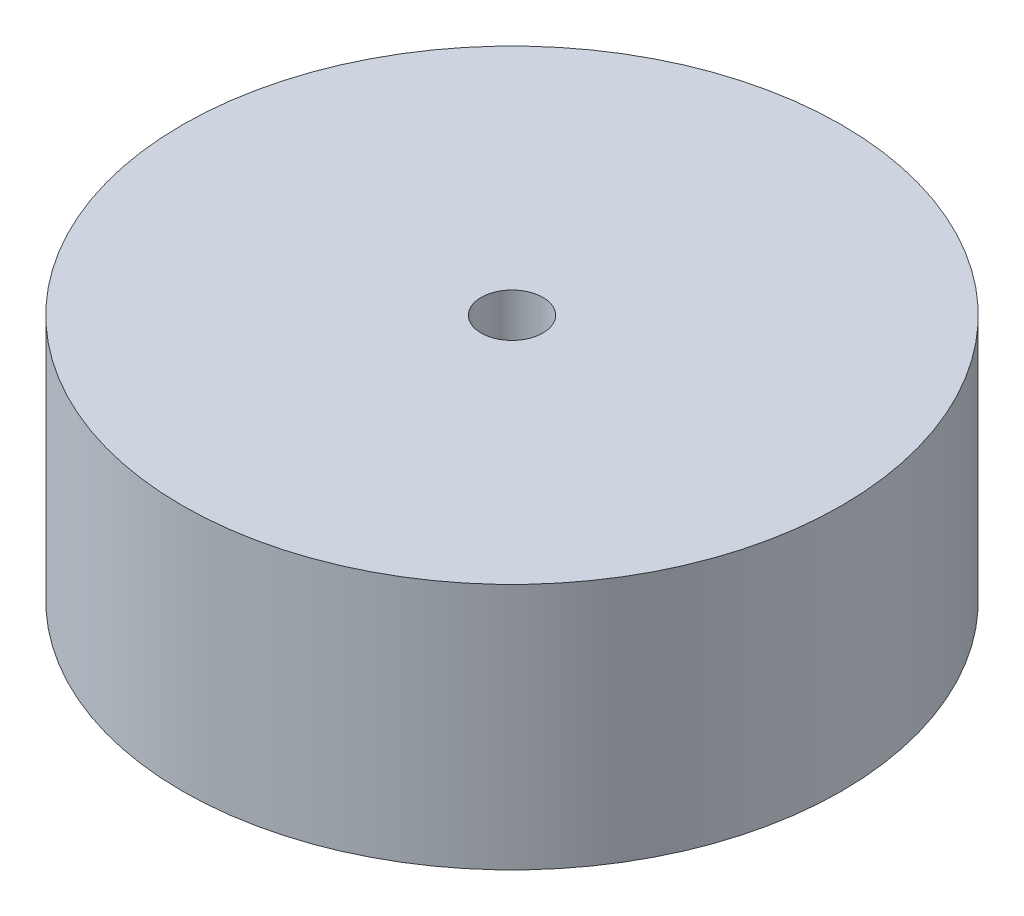
ISO-10303-21;
HEADER;
FILE_DESCRIPTION(('STEP AP214'),'2;1');
FILE_NAME('part.step','',(''),(''),'','','');
FILE_SCHEMA(('AUTOMOTIVE_DESIGN { 1 0 10303 214 1 1 1 1 }'));
ENDSEC;
DATA;
#1=APPLICATION_CONTEXT('core data for automotive mechanical design processes');
#2=APPLICATION_PROTOCOL_DEFINITION('international standard','automotive_design',2000,#1);
#3=PRODUCT_CONTEXT('',#1,'mechanical');
#4=PRODUCT('Part','Part','',(#3));
#5=PRODUCT_RELATED_PRODUCT_CATEGORY('part','',(#4));
#6=PRODUCT_DEFINITION_FORMATION('','',#4);
#7=PRODUCT_DEFINITION_CONTEXT('part definition',#1,'design');
#8=PRODUCT_DEFINITION('design','',#6,#7);
#9=PRODUCT_DEFINITION_SHAPE('','',#8);
#10=(LENGTH_UNIT() NAMED_UNIT(*) SI_UNIT(.MILLI.,.METRE.));
#11=(NAMED_UNIT(*) PLANE_ANGLE_UNIT() SI_UNIT($,.RADIAN.));
#12=(NAMED_UNIT(*) SI_UNIT($,.STERADIAN.) SOLID_ANGLE_UNIT());
#13=UNCERTAINTY_MEASURE_WITH_UNIT(LENGTH_MEASURE(1.E-05),#10,'distance_accuracy_value','');
#14=(GEOMETRIC_REPRESENTATION_CONTEXT(3) GLOBAL_UNCERTAINTY_ASSIGNED_CONTEXT((#13)) GLOBAL_UNIT_ASSIGNED_CONTEXT((#10,
#11,#12)) REPRESENTATION_CONTEXT('',''));
#15=CARTESIAN_POINT('',(0.,0.,0.));
#16=DIRECTION('',(0.,0.,1.));
#17=DIRECTION('',(1.,0.,0.));
#18=AXIS2_PLACEMENT_3D('',#15,#16,#17);
#19=CARTESIAN_POINT('',(0.,24.,0.));
#20=DIRECTION('',(0.,-1.,0.));
#21=DIRECTION('',(0.,0.,-1.));
#22=AXIS2_PLACEMENT_3D('',#19,#20,#21);
#23=CYLINDRICAL_SURFACE('',#22,32.);
#24=CARTESIAN_POINT('',(0.,24.,0.));
#25=DIRECTION('',(0.,1.,0.));
#26=DIRECTION('',(0.,0.,1.));
#27=AXIS2_PLACEMENT_3D('',#24,#25,#26);
#28=CIRCLE('',#27,32.);
#29=CARTESIAN_POINT('',(0.,24.,32.));
#30=VERTEX_POINT('',#29);
#31=EDGE_CURVE('E10',#30,#30,#28,.T.);
#32=ORIENTED_EDGE('',*,*,#31,.F.);
#33=EDGE_LOOP('',(#32));
#34=FACE_BOUND('',#33,.T.);
#35=CARTESIAN_POINT('',(0.,0.,0.));
#36=DIRECTION('',(0.,1.,0.));
#37=DIRECTION('',(0.,0.,1.));
#38=AXIS2_PLACEMENT_3D('',#35,#36,#37);
#39=CIRCLE('',#38,32.);
#40=CARTESIAN_POINT('',(0.,0.,32.));
#41=VERTEX_POINT('',#40);
#42=EDGE_CURVE('E36',#41,#41,#39,.T.);
#43=ORIENTED_EDGE('',*,*,#42,.T.);
#44=EDGE_LOOP('',(#43));
#45=FACE_BOUND('',#44,.T.);
#46=ADVANCED_FACE('F33',(#34,#45),#23,.T.);
#47=CARTESIAN_POINT('',(0.,24.,0.));
#48=DIRECTION('',(0.,1.,0.));
#49=DIRECTION('',(0.,0.,1.));
#50=AXIS2_PLACEMENT_3D('',#47,#48,#49);
#51=PLANE('',#50);
#52=CARTESIAN_POINT('',(0.,24.,0.));
#53=DIRECTION('',(0.,1.,0.));
#54=DIRECTION('',(0.,0.,1.));
#55=AXIS2_PLACEMENT_3D('',#52,#53,#54);
#56=CIRCLE('',#55,3.);
#57=CARTESIAN_POINT('',(0.,24.,3.));
#58=VERTEX_POINT('',#57);
#59=EDGE_CURVE('E45',#58,#58,#56,.T.);
#60=ORIENTED_EDGE('',*,*,#59,.F.);
#61=EDGE_LOOP('',(#60));
#62=FACE_BOUND('',#61,.T.);
#63=ORIENTED_EDGE('',*,*,#31,.T.);
#64=EDGE_LOOP('',(#63));
#65=FACE_BOUND('',#64,.T.);
#66=ADVANCED_FACE('F60',(#62,#65),#51,.T.);
#67=CARTESIAN_POINT('',(0.,0.,0.));
#68=DIRECTION('',(0.,1.,0.));
#69=DIRECTION('',(0.,0.,1.));
#70=AXIS2_PLACEMENT_3D('',#67,#68,#69);
#71=PLANE('',#70);
#72=CARTESIAN_POINT('',(0.,0.,0.));
#73=DIRECTION('',(0.,1.,0.));
#74=DIRECTION('',(0.,0.,1.));
#75=AXIS2_PLACEMENT_3D('',#72,#73,#74);
#76=CIRCLE('',#75,3.);
#77=CARTESIAN_POINT('',(0.,0.,3.));
#78=VERTEX_POINT('',#77);
#79=EDGE_CURVE('E43',#78,#78,#76,.T.);
#80=ORIENTED_EDGE('',*,*,#79,.T.);
#81=EDGE_LOOP('',(#80));
#82=FACE_BOUND('',#81,.T.);
#83=ORIENTED_EDGE('',*,*,#42,.F.);
#84=EDGE_LOOP('',(#83));
#85=FACE_BOUND('',#84,.T.);
#86=ADVANCED_FACE('F51',(#82,#85),#71,.F.);
#87=CARTESIAN_POINT('',(0.,0.,0.));
#88=DIRECTION('',(0.,1.,0.));
#89=DIRECTION('',(0.,0.,1.));
#90=AXIS2_PLACEMENT_3D('',#87,#88,#89);
#91=CYLINDRICAL_SURFACE('',#90,3.);
#92=ORIENTED_EDGE('',*,*,#79,.F.);
#93=EDGE_LOOP('',(#92));
#94=FACE_BOUND('',#93,.T.);
#95=ORIENTED_EDGE('',*,*,#59,.T.);
#96=EDGE_LOOP('',(#95));
#97=FACE_BOUND('',#96,.T.);
#98=ADVANCED_FACE('F54',(#94,#97),#91,.F.);
#99=CLOSED_SHELL('',(#46,#66,#86,#98));
#100=MANIFOLD_SOLID_BREP('B2',#99);
#101=ADVANCED_BREP_SHAPE_REPRESENTATION('',(#18,#100),#14);
#102=SHAPE_DEFINITION_REPRESENTATION(#9,#101);
ENDSEC;
END-ISO-10303-21;
